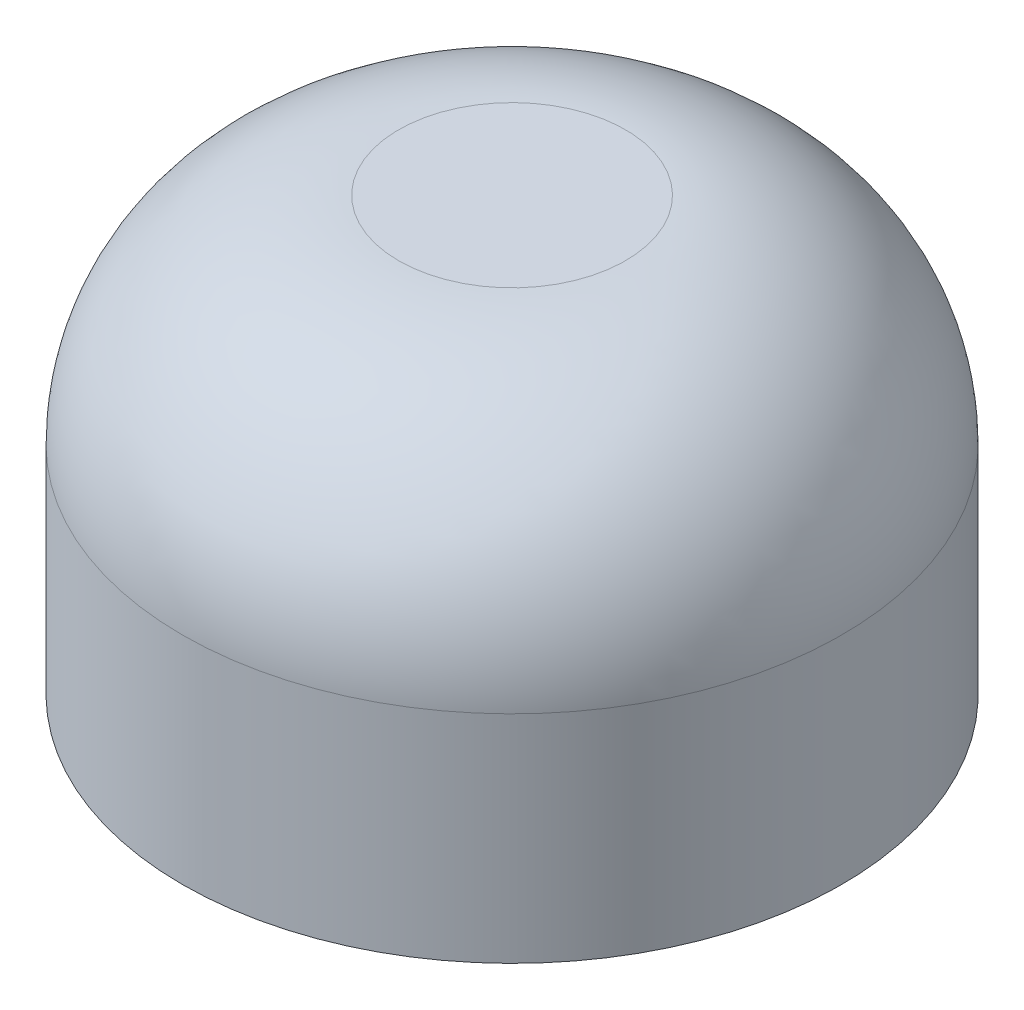
ISO-10303-21;
HEADER;
FILE_DESCRIPTION(('STEP AP214'),'2;1');
FILE_NAME('part.step','',(''),(''),'','','');
FILE_SCHEMA(('AUTOMOTIVE_DESIGN { 1 0 10303 214 1 1 1 1 }'));
ENDSEC;
DATA;
#1=APPLICATION_CONTEXT('core data for automotive mechanical design processes');
#2=APPLICATION_PROTOCOL_DEFINITION('international standard','automotive_design',2000,#1);
#3=PRODUCT_CONTEXT('',#1,'mechanical');
#4=PRODUCT('Part','Part','',(#3));
#5=PRODUCT_RELATED_PRODUCT_CATEGORY('part','',(#4));
#6=PRODUCT_DEFINITION_FORMATION('','',#4);
#7=PRODUCT_DEFINITION_CONTEXT('part definition',#1,'design');
#8=PRODUCT_DEFINITION('design','',#6,#7);
#9=PRODUCT_DEFINITION_SHAPE('','',#8);
#10=(LENGTH_UNIT() NAMED_UNIT(*) SI_UNIT(.MILLI.,.METRE.));
#11=(NAMED_UNIT(*) PLANE_ANGLE_UNIT() SI_UNIT($,.RADIAN.));
#12=(NAMED_UNIT(*) SI_UNIT($,.STERADIAN.) SOLID_ANGLE_UNIT());
#13=UNCERTAINTY_MEASURE_WITH_UNIT(LENGTH_MEASURE(1.E-05),#10,'distance_accuracy_value','');
#14=(GEOMETRIC_REPRESENTATION_CONTEXT(3) GLOBAL_UNCERTAINTY_ASSIGNED_CONTEXT((#13)) GLOBAL_UNIT_ASSIGNED_CONTEXT((#10,
#11,#12)) REPRESENTATION_CONTEXT('',''));
#15=CARTESIAN_POINT('',(0.,0.,0.));
#16=DIRECTION('',(0.,0.,1.));
#17=DIRECTION('',(1.,0.,0.));
#18=AXIS2_PLACEMENT_3D('',#15,#16,#17);
#19=CARTESIAN_POINT('',(0.,0.,0.));
#20=DIRECTION('',(0.,1.,0.));
#21=DIRECTION('',(0.,0.,1.));
#22=AXIS2_PLACEMENT_3D('',#19,#20,#21);
#23=PLANE('',#22);
#24=CARTESIAN_POINT('',(0.,0.,0.));
#25=DIRECTION('',(0.,1.,0.));
#26=DIRECTION('',(0.,0.,1.));
#27=AXIS2_PLACEMENT_3D('',#24,#25,#26);
#28=CIRCLE('',#27,3.05);
#29=CARTESIAN_POINT('',(0.,0.,3.05));
#30=VERTEX_POINT('',#29);
#31=EDGE_CURVE('E43',#30,#30,#28,.T.);
#32=ORIENTED_EDGE('',*,*,#31,.F.);
#33=EDGE_LOOP('',(#32));
#34=FACE_BOUND('',#33,.T.);
#35=CARTESIAN_POINT('',(0.,0.,0.));
#36=DIRECTION('',(0.,1.,0.));
#37=DIRECTION('',(0.,0.,1.));
#38=AXIS2_PLACEMENT_3D('',#35,#36,#37);
#39=CIRCLE('',#38,1.55);
#40=CARTESIAN_POINT('',(0.,0.,1.55));
#41=VERTEX_POINT('',#40);
#42=EDGE_CURVE('E47',#41,#41,#39,.T.);
#43=ORIENTED_EDGE('',*,*,#42,.T.);
#44=EDGE_LOOP('',(#43));
#45=FACE_BOUND('',#44,.T.);
#46=ADVANCED_FACE('F32',(#34,#45),#23,.F.);
#47=CARTESIAN_POINT('',(0.,2.,0.));
#48=DIRECTION('',(0.,-1.,0.));
#49=DIRECTION('',(0.,0.,-1.));
#50=AXIS2_PLACEMENT_3D('',#47,#48,#49);
#51=CYLINDRICAL_SURFACE('',#50,3.05);
#52=CARTESIAN_POINT('',(0.,2.,0.));
#53=DIRECTION('',(0.,1.,0.));
#54=DIRECTION('',(0.,0.,1.));
#55=AXIS2_PLACEMENT_3D('',#52,#53,#54);
#56=CIRCLE('',#55,3.05);
#57=CARTESIAN_POINT('',(0.,2.,3.05));
#58=VERTEX_POINT('',#57);
#59=EDGE_CURVE('E10',#58,#58,#56,.F.);
#60=ORIENTED_EDGE('',*,*,#59,.T.);
#61=EDGE_LOOP('',(#60));
#62=FACE_BOUND('',#61,.T.);
#63=ORIENTED_EDGE('',*,*,#31,.T.);
#64=EDGE_LOOP('',(#63));
#65=FACE_BOUND('',#64,.T.);
#66=ADVANCED_FACE('F68',(#62,#65),#51,.T.);
#67=CARTESIAN_POINT('',(0.,2.,0.));
#68=DIRECTION('',(0.,-1.,0.));
#69=DIRECTION('',(0.,0.,-1.));
#70=AXIS2_PLACEMENT_3D('',#67,#68,#69);
#71=CYLINDRICAL_SURFACE('',#70,1.55);
#72=CARTESIAN_POINT('',(0.,2.,0.));
#73=DIRECTION('',(0.,1.,0.));
#74=DIRECTION('',(0.,0.,1.));
#75=AXIS2_PLACEMENT_3D('',#72,#73,#74);
#76=CIRCLE('',#75,1.55);
#77=CARTESIAN_POINT('',(0.,2.,1.55));
#78=VERTEX_POINT('',#77);
#79=EDGE_CURVE('E52',#78,#78,#76,.T.);
#80=ORIENTED_EDGE('',*,*,#79,.T.);
#81=EDGE_LOOP('',(#80));
#82=FACE_BOUND('',#81,.T.);
#83=ORIENTED_EDGE('',*,*,#42,.F.);
#84=EDGE_LOOP('',(#83));
#85=FACE_BOUND('',#84,.T.);
#86=ADVANCED_FACE('F56',(#82,#85),#71,.F.);
#87=CARTESIAN_POINT('',(0.,2.,0.));
#88=DIRECTION('',(0.,1.,0.));
#89=DIRECTION('',(0.,0.,1.));
#90=AXIS2_PLACEMENT_3D('',#87,#88,#89);
#91=PLANE('',#90);
#92=ORIENTED_EDGE('',*,*,#79,.F.);
#93=EDGE_LOOP('',(#92));
#94=FACE_BOUND('',#93,.T.);
#95=ADVANCED_FACE('F59',(#94),#91,.F.);
#96=CARTESIAN_POINT('',(0.,4.,0.));
#97=DIRECTION('',(0.,1.,0.));
#98=DIRECTION('',(0.,0.,1.));
#99=AXIS2_PLACEMENT_3D('',#96,#97,#98);
#100=PLANE('',#99);
#101=CARTESIAN_POINT('',(0.,4.,0.));
#102=DIRECTION('',(0.,1.,0.));
#103=DIRECTION('',(0.,0.,1.));
#104=AXIS2_PLACEMENT_3D('',#101,#102,#103);
#105=CIRCLE('',#104,1.05);
#106=CARTESIAN_POINT('',(0.,4.,1.05));
#107=VERTEX_POINT('',#106);
#108=EDGE_CURVE('E39',#107,#107,#105,.T.);
#109=ORIENTED_EDGE('',*,*,#108,.T.);
#110=EDGE_LOOP('',(#109));
#111=FACE_BOUND('',#110,.T.);
#112=ADVANCED_FACE('F61',(#111),#100,.T.);
#113=CARTESIAN_POINT('',(0.,2.,0.));
#114=DIRECTION('',(0.,1.,0.));
#115=DIRECTION('',(0.,0.,1.));
#116=AXIS2_PLACEMENT_3D('',#113,#114,#115);
#117=DEGENERATE_TOROIDAL_SURFACE('',#116,1.05,2.,.T.);
#118=ORIENTED_EDGE('',*,*,#59,.F.);
#119=EDGE_LOOP('',(#118));
#120=FACE_BOUND('',#119,.T.);
#121=ORIENTED_EDGE('',*,*,#108,.F.);
#122=EDGE_LOOP('',(#121));
#123=FACE_BOUND('',#122,.T.);
#124=ADVANCED_FACE('F34',(#120,#123),#117,.T.);
#125=CLOSED_SHELL('',(#46,#66,#86,#95,#112,#124));
#126=MANIFOLD_SOLID_BREP('B2',#125);
#127=ADVANCED_BREP_SHAPE_REPRESENTATION('',(#18,#126),#14);
#128=SHAPE_DEFINITION_REPRESENTATION(#9,#127);
ENDSEC;
END-ISO-10303-21;
